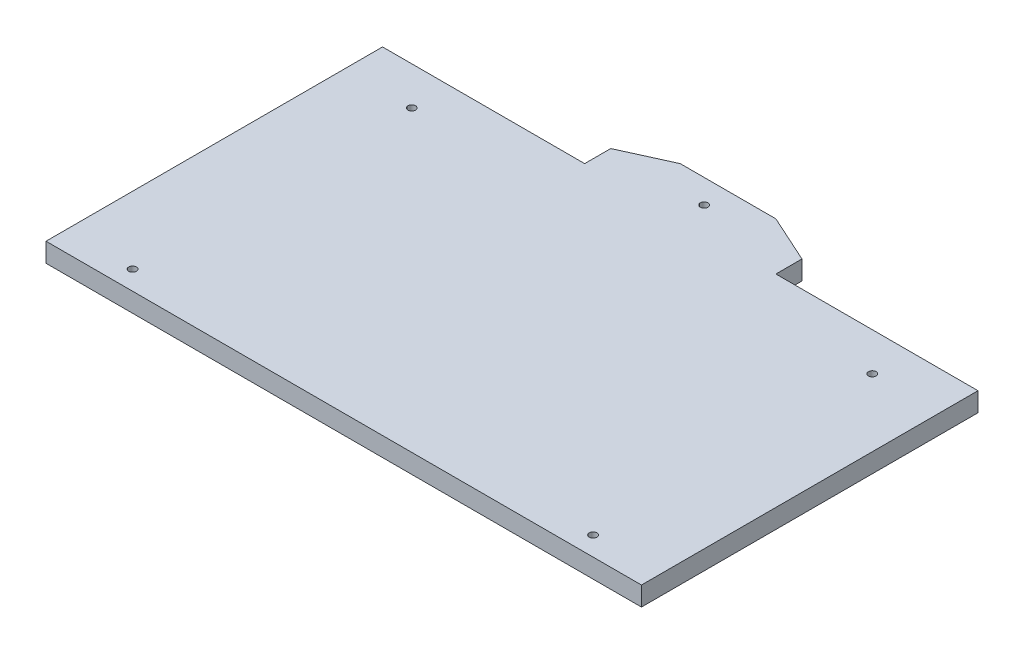
ISO-10303-21;
HEADER;
FILE_DESCRIPTION(('STEP AP214'),'2;1');
FILE_NAME('part.step','',(''),(''),'','','');
FILE_SCHEMA(('AUTOMOTIVE_DESIGN { 1 0 10303 214 1 1 1 1 }'));
ENDSEC;
DATA;
#1=APPLICATION_CONTEXT('core data for automotive mechanical design processes');
#2=APPLICATION_PROTOCOL_DEFINITION('international standard','automotive_design',2000,#1);
#3=PRODUCT_CONTEXT('',#1,'mechanical');
#4=PRODUCT('Part','Part','',(#3));
#5=PRODUCT_RELATED_PRODUCT_CATEGORY('part','',(#4));
#6=PRODUCT_DEFINITION_FORMATION('','',#4);
#7=PRODUCT_DEFINITION_CONTEXT('part definition',#1,'design');
#8=PRODUCT_DEFINITION('design','',#6,#7);
#9=PRODUCT_DEFINITION_SHAPE('','',#8);
#10=(LENGTH_UNIT() NAMED_UNIT(*) SI_UNIT(.MILLI.,.METRE.));
#11=(NAMED_UNIT(*) PLANE_ANGLE_UNIT() SI_UNIT($,.RADIAN.));
#12=(NAMED_UNIT(*) SI_UNIT($,.STERADIAN.) SOLID_ANGLE_UNIT());
#13=UNCERTAINTY_MEASURE_WITH_UNIT(LENGTH_MEASURE(1.E-05),#10,'distance_accuracy_value','');
#14=(GEOMETRIC_REPRESENTATION_CONTEXT(3) GLOBAL_UNCERTAINTY_ASSIGNED_CONTEXT((#13)) GLOBAL_UNIT_ASSIGNED_CONTEXT((#10,
#11,#12)) REPRESENTATION_CONTEXT('',''));
#15=CARTESIAN_POINT('',(0.,0.,0.));
#16=DIRECTION('',(0.,0.,1.));
#17=DIRECTION('',(1.,0.,0.));
#18=AXIS2_PLACEMENT_3D('',#15,#16,#17);
#19=CARTESIAN_POINT('',(0.,5.,-44.));
#20=DIRECTION('',(0.,0.,1.));
#21=DIRECTION('',(1.,0.,0.));
#22=AXIS2_PLACEMENT_3D('',#19,#20,#21);
#23=PLANE('',#22);
#24=DIRECTION('',(0.,1.,0.));
#25=VECTOR('',#24,1.);
#26=CARTESIAN_POINT('',(-23.8283042472908,-51.537589944117,-44.));
#27=LINE('',#26,#25);
#28=CARTESIAN_POINT('',(-23.8283042472908,0.,-44.));
#29=VERTEX_POINT('',#28);
#30=CARTESIAN_POINT('',(-23.8283042472908,5.,-44.));
#31=VERTEX_POINT('',#30);
#32=EDGE_CURVE('E72',#29,#31,#27,.T.);
#33=ORIENTED_EDGE('',*,*,#32,.F.);
#34=DIRECTION('',(-1.,0.,0.));
#35=VECTOR('',#34,1.);
#36=CARTESIAN_POINT('',(0.,0.,-44.));
#37=LINE('',#36,#35);
#38=CARTESIAN_POINT('',(-76.6797078460986,0.,-44.));
#39=VERTEX_POINT('',#38);
#40=EDGE_CURVE('E210',#29,#39,#37,.T.);
#41=ORIENTED_EDGE('',*,*,#40,.T.);
#42=DIRECTION('',(0.,-1.,0.));
#43=VECTOR('',#42,1.);
#44=CARTESIAN_POINT('',(-76.6797078460986,5.,-44.));
#45=LINE('',#44,#43);
#46=CARTESIAN_POINT('',(-76.6797078460986,5.,-44.));
#47=VERTEX_POINT('',#46);
#48=EDGE_CURVE('E57',#47,#39,#45,.T.);
#49=ORIENTED_EDGE('',*,*,#48,.F.);
#50=DIRECTION('',(-1.,0.,0.));
#51=VECTOR('',#50,1.);
#52=CARTESIAN_POINT('',(0.,5.,-44.));
#53=LINE('',#52,#51);
#54=EDGE_CURVE('E196',#31,#47,#53,.T.);
#55=ORIENTED_EDGE('',*,*,#54,.F.);
#56=EDGE_LOOP('',(#33,#41,#49,#55));
#57=FACE_BOUND('',#56,.T.);
#58=ADVANCED_FACE('F48',(#57),#23,.F.);
#59=CARTESIAN_POINT('',(79.023099351517,5.,0.));
#60=DIRECTION('',(1.,0.,0.));
#61=DIRECTION('',(0.,0.,-1.));
#62=AXIS2_PLACEMENT_3D('',#59,#60,#61);
#63=PLANE('',#62);
#64=DIRECTION('',(0.,0.,1.));
#65=VECTOR('',#64,1.);
#66=CARTESIAN_POINT('',(79.023099351517,0.,0.));
#67=LINE('',#66,#65);
#68=CARTESIAN_POINT('',(79.023099351517,0.,-44.));
#69=VERTEX_POINT('',#68);
#70=CARTESIAN_POINT('',(79.023099351517,0.,44.));
#71=VERTEX_POINT('',#70);
#72=EDGE_CURVE('E190',#69,#71,#67,.T.);
#73=ORIENTED_EDGE('',*,*,#72,.F.);
#74=DIRECTION('',(0.,-1.,0.));
#75=VECTOR('',#74,1.);
#76=CARTESIAN_POINT('',(79.023099351517,5.,-44.));
#77=LINE('',#76,#75);
#78=CARTESIAN_POINT('',(79.023099351517,5.,-44.));
#79=VERTEX_POINT('',#78);
#80=EDGE_CURVE('E11',#79,#69,#77,.T.);
#81=ORIENTED_EDGE('',*,*,#80,.F.);
#82=DIRECTION('',(0.,0.,1.));
#83=VECTOR('',#82,1.);
#84=CARTESIAN_POINT('',(79.023099351517,5.,0.));
#85=LINE('',#84,#83);
#86=CARTESIAN_POINT('',(79.023099351517,5.,44.));
#87=VERTEX_POINT('',#86);
#88=EDGE_CURVE('E192',#79,#87,#85,.T.);
#89=ORIENTED_EDGE('',*,*,#88,.T.);
#90=DIRECTION('',(0.,-1.,0.));
#91=VECTOR('',#90,1.);
#92=CARTESIAN_POINT('',(79.023099351517,5.,44.));
#93=LINE('',#92,#91);
#94=EDGE_CURVE('E206',#87,#71,#93,.T.);
#95=ORIENTED_EDGE('',*,*,#94,.T.);
#96=EDGE_LOOP('',(#73,#81,#89,#95));
#97=FACE_BOUND('',#96,.T.);
#98=ADVANCED_FACE('F50',(#97),#63,.T.);
#99=CARTESIAN_POINT('',(26.1716957527092,0.,-44.));
#100=VERTEX_POINT('',#99);
#101=EDGE_CURVE('E211',#69,#100,#37,.T.);
#102=ORIENTED_EDGE('',*,*,#101,.T.);
#103=DIRECTION('',(0.,1.,0.));
#104=VECTOR('',#103,1.);
#105=CARTESIAN_POINT('',(26.1716957527092,-51.537589944117,-44.));
#106=LINE('',#105,#104);
#107=CARTESIAN_POINT('',(26.1716957527092,5.,-44.));
#108=VERTEX_POINT('',#107);
#109=EDGE_CURVE('E64',#100,#108,#106,.T.);
#110=ORIENTED_EDGE('',*,*,#109,.T.);
#111=EDGE_CURVE('E153',#79,#108,#53,.T.);
#112=ORIENTED_EDGE('',*,*,#111,.F.);
#113=ORIENTED_EDGE('',*,*,#80,.T.);
#114=EDGE_LOOP('',(#102,#110,#112,#113));
#115=FACE_BOUND('',#114,.T.);
#116=ADVANCED_FACE('F330',(#115),#23,.F.);
#117=CARTESIAN_POINT('',(-76.6797078460986,5.,0.));
#118=DIRECTION('',(1.,0.,0.));
#119=DIRECTION('',(0.,0.,-1.));
#120=AXIS2_PLACEMENT_3D('',#117,#118,#119);
#121=PLANE('',#120);
#122=DIRECTION('',(0.,0.,1.));
#123=VECTOR('',#122,1.);
#124=CARTESIAN_POINT('',(-76.6797078460986,0.,0.));
#125=LINE('',#124,#123);
#126=CARTESIAN_POINT('',(-76.6797078460986,0.,44.));
#127=VERTEX_POINT('',#126);
#128=EDGE_CURVE('E214',#39,#127,#125,.T.);
#129=ORIENTED_EDGE('',*,*,#128,.T.);
#130=DIRECTION('',(0.,-1.,0.));
#131=VECTOR('',#130,1.);
#132=CARTESIAN_POINT('',(-76.6797078460986,5.,44.));
#133=LINE('',#132,#131);
#134=CARTESIAN_POINT('',(-76.6797078460986,5.,44.));
#135=VERTEX_POINT('',#134);
#136=EDGE_CURVE('E222',#135,#127,#133,.T.);
#137=ORIENTED_EDGE('',*,*,#136,.F.);
#138=DIRECTION('',(0.,0.,1.));
#139=VECTOR('',#138,1.);
#140=CARTESIAN_POINT('',(-76.6797078460986,5.,0.));
#141=LINE('',#140,#139);
#142=EDGE_CURVE('E200',#47,#135,#141,.T.);
#143=ORIENTED_EDGE('',*,*,#142,.F.);
#144=ORIENTED_EDGE('',*,*,#48,.T.);
#145=EDGE_LOOP('',(#129,#137,#143,#144));
#146=FACE_BOUND('',#145,.T.);
#147=ADVANCED_FACE('F232',(#146),#121,.F.);
#148=CARTESIAN_POINT('',(0.,5.,44.));
#149=DIRECTION('',(0.,0.,-1.));
#150=DIRECTION('',(-1.,0.,0.));
#151=AXIS2_PLACEMENT_3D('',#148,#149,#150);
#152=PLANE('',#151);
#153=DIRECTION('',(1.,0.,0.));
#154=VECTOR('',#153,1.);
#155=CARTESIAN_POINT('',(0.,0.,44.));
#156=LINE('',#155,#154);
#157=EDGE_CURVE('E197',#127,#71,#156,.T.);
#158=ORIENTED_EDGE('',*,*,#157,.T.);
#159=ORIENTED_EDGE('',*,*,#94,.F.);
#160=DIRECTION('',(1.,0.,0.));
#161=VECTOR('',#160,1.);
#162=CARTESIAN_POINT('',(0.,5.,44.));
#163=LINE('',#162,#161);
#164=EDGE_CURVE('E203',#135,#87,#163,.T.);
#165=ORIENTED_EDGE('',*,*,#164,.F.);
#166=ORIENTED_EDGE('',*,*,#136,.T.);
#167=EDGE_LOOP('',(#158,#159,#165,#166));
#168=FACE_BOUND('',#167,.T.);
#169=ADVANCED_FACE('F243',(#168),#152,.F.);
#170=CARTESIAN_POINT('',(0.,5.,0.));
#171=DIRECTION('',(0.,1.,0.));
#172=DIRECTION('',(0.,0.,1.));
#173=AXIS2_PLACEMENT_3D('',#170,#171,#172);
#174=PLANE('',#173);
#175=ORIENTED_EDGE('',*,*,#88,.F.);
#176=ORIENTED_EDGE('',*,*,#111,.T.);
#177=DIRECTION('',(0.,0.,-1.));
#178=VECTOR('',#177,1.);
#179=CARTESIAN_POINT('',(26.1716957527092,5.,-44.));
#180=LINE('',#179,#178);
#181=CARTESIAN_POINT('',(26.1716957527092,5.,-50.823606938333));
#182=VERTEX_POINT('',#181);
#183=EDGE_CURVE('E131',#108,#182,#180,.T.);
#184=ORIENTED_EDGE('',*,*,#183,.T.);
#185=DIRECTION('',(-0.910654396943775,0.,-0.413168935578379));
#186=VECTOR('',#185,1.);
#187=CARTESIAN_POINT('',(26.1716957527092,5.,-50.823606938333));
#188=LINE('',#187,#186);
#189=CARTESIAN_POINT('',(13.6716957527092,5.,-56.4949260601234));
#190=VERTEX_POINT('',#189);
#191=EDGE_CURVE('E141',#182,#190,#188,.T.);
#192=ORIENTED_EDGE('',*,*,#191,.T.);
#193=DIRECTION('',(-1.,0.,0.));
#194=VECTOR('',#193,1.);
#195=CARTESIAN_POINT('',(13.6716957527092,5.,-56.4949260601234));
#196=LINE('',#195,#194);
#197=CARTESIAN_POINT('',(-11.3283042472908,5.,-56.4949260601235));
#198=VERTEX_POINT('',#197);
#199=EDGE_CURVE('E148',#190,#198,#196,.T.);
#200=ORIENTED_EDGE('',*,*,#199,.T.);
#201=DIRECTION('',(-0.910654396943774,0.,0.41316893557838));
#202=VECTOR('',#201,1.);
#203=CARTESIAN_POINT('',(-11.3283042472908,5.,-56.4949260601235));
#204=LINE('',#203,#202);
#205=CARTESIAN_POINT('',(-23.8283042472908,5.,-50.823606938333));
#206=VERTEX_POINT('',#205);
#207=EDGE_CURVE('E166',#198,#206,#204,.T.);
#208=ORIENTED_EDGE('',*,*,#207,.T.);
#209=DIRECTION('',(0.,0.,1.));
#210=VECTOR('',#209,1.);
#211=CARTESIAN_POINT('',(-23.8283042472908,5.,-50.823606938333));
#212=LINE('',#211,#210);
#213=EDGE_CURVE('E138',#206,#31,#212,.T.);
#214=ORIENTED_EDGE('',*,*,#213,.T.);
#215=ORIENTED_EDGE('',*,*,#54,.T.);
#216=ORIENTED_EDGE('',*,*,#142,.T.);
#217=ORIENTED_EDGE('',*,*,#164,.T.);
#218=EDGE_LOOP('',(#175,#176,#184,#192,#200,#208,#214,#215,#216,#217));
#219=FACE_BOUND('',#218,.T.);
#220=CARTESIAN_POINT('',(1.17169575270918,5.,-50.2474630300617));
#221=DIRECTION('',(0.,1.,0.));
#222=DIRECTION('',(0.,0.,1.));
#223=AXIS2_PLACEMENT_3D('',#220,#221,#222);
#224=CIRCLE('',#223,1.);
#225=CARTESIAN_POINT('',(1.17169575270918,5.,-49.2474630300617));
#226=VERTEX_POINT('',#225);
#227=EDGE_CURVE('E155',#226,#226,#224,.T.);
#228=ORIENTED_EDGE('',*,*,#227,.F.);
#229=EDGE_LOOP('',(#228));
#230=FACE_BOUND('',#229,.T.);
#231=CARTESIAN_POINT('',(61.3854570382798,5.,-34.));
#232=DIRECTION('',(0.,1.,0.));
#233=DIRECTION('',(0.,0.,1.));
#234=AXIS2_PLACEMENT_3D('',#231,#232,#233);
#235=CIRCLE('',#234,1.);
#236=CARTESIAN_POINT('',(61.3854570382798,5.,-33.));
#237=VERTEX_POINT('',#236);
#238=EDGE_CURVE('E288',#237,#237,#235,.T.);
#239=ORIENTED_EDGE('',*,*,#238,.F.);
#240=EDGE_LOOP('',(#239));
#241=FACE_BOUND('',#240,.T.);
#242=CARTESIAN_POINT('',(61.3854570382798,5.,39.));
#243=DIRECTION('',(0.,1.,0.));
#244=DIRECTION('',(0.,0.,1.));
#245=AXIS2_PLACEMENT_3D('',#242,#243,#244);
#246=CIRCLE('',#245,1.);
#247=CARTESIAN_POINT('',(61.3854570382798,5.,40.));
#248=VERTEX_POINT('',#247);
#249=EDGE_CURVE('E296',#248,#248,#246,.T.);
#250=ORIENTED_EDGE('',*,*,#249,.F.);
#251=EDGE_LOOP('',(#250));
#252=FACE_BOUND('',#251,.T.);
#253=CARTESIAN_POINT('',(-59.0420655328614,5.,39.));
#254=DIRECTION('',(0.,1.,0.));
#255=DIRECTION('',(0.,0.,1.));
#256=AXIS2_PLACEMENT_3D('',#253,#254,#255);
#257=CIRCLE('',#256,0.999999999999994);
#258=CARTESIAN_POINT('',(-59.0420655328614,5.,40.));
#259=VERTEX_POINT('',#258);
#260=EDGE_CURVE('E304',#259,#259,#257,.T.);
#261=ORIENTED_EDGE('',*,*,#260,.F.);
#262=EDGE_LOOP('',(#261));
#263=FACE_BOUND('',#262,.T.);
#264=CARTESIAN_POINT('',(-59.0420655328614,5.,-34.));
#265=DIRECTION('',(0.,1.,0.));
#266=DIRECTION('',(0.,0.,1.));
#267=AXIS2_PLACEMENT_3D('',#264,#265,#266);
#268=CIRCLE('',#267,0.999999999999994);
#269=CARTESIAN_POINT('',(-59.0420655328614,5.,-33.));
#270=VERTEX_POINT('',#269);
#271=EDGE_CURVE('E312',#270,#270,#268,.T.);
#272=ORIENTED_EDGE('',*,*,#271,.F.);
#273=EDGE_LOOP('',(#272));
#274=FACE_BOUND('',#273,.T.);
#275=ADVANCED_FACE('F151',(#219,#230,#241,#252,#263,#274),#174,.T.);
#276=CARTESIAN_POINT('',(0.,0.,0.));
#277=DIRECTION('',(0.,1.,0.));
#278=DIRECTION('',(0.,0.,1.));
#279=AXIS2_PLACEMENT_3D('',#276,#277,#278);
#280=PLANE('',#279);
#281=ORIENTED_EDGE('',*,*,#72,.T.);
#282=ORIENTED_EDGE('',*,*,#157,.F.);
#283=ORIENTED_EDGE('',*,*,#128,.F.);
#284=ORIENTED_EDGE('',*,*,#40,.F.);
#285=DIRECTION('',(0.,0.,-1.));
#286=VECTOR('',#285,1.);
#287=CARTESIAN_POINT('',(-23.8283042472908,0.,-50.823606938333));
#288=LINE('',#287,#286);
#289=CARTESIAN_POINT('',(-23.8283042472908,0.,-50.823606938333));
#290=VERTEX_POINT('',#289);
#291=EDGE_CURVE('E263',#29,#290,#288,.T.);
#292=ORIENTED_EDGE('',*,*,#291,.T.);
#293=DIRECTION('',(0.910654396943774,0.,-0.41316893557838));
#294=VECTOR('',#293,1.);
#295=CARTESIAN_POINT('',(-11.3283042472908,0.,-56.4949260601235));
#296=LINE('',#295,#294);
#297=CARTESIAN_POINT('',(-11.3283042472908,0.,-56.4949260601235));
#298=VERTEX_POINT('',#297);
#299=EDGE_CURVE('E266',#290,#298,#296,.T.);
#300=ORIENTED_EDGE('',*,*,#299,.T.);
#301=DIRECTION('',(1.,0.,0.));
#302=VECTOR('',#301,1.);
#303=CARTESIAN_POINT('',(13.6716957527092,0.,-56.4949260601234));
#304=LINE('',#303,#302);
#305=CARTESIAN_POINT('',(13.6716957527092,0.,-56.4949260601234));
#306=VERTEX_POINT('',#305);
#307=EDGE_CURVE('E175',#298,#306,#304,.T.);
#308=ORIENTED_EDGE('',*,*,#307,.T.);
#309=DIRECTION('',(0.910654396943775,0.,0.413168935578379));
#310=VECTOR('',#309,1.);
#311=CARTESIAN_POINT('',(26.1716957527092,0.,-50.823606938333));
#312=LINE('',#311,#310);
#313=CARTESIAN_POINT('',(26.1716957527092,0.,-50.823606938333));
#314=VERTEX_POINT('',#313);
#315=EDGE_CURVE('E191',#306,#314,#312,.T.);
#316=ORIENTED_EDGE('',*,*,#315,.T.);
#317=DIRECTION('',(0.,0.,1.));
#318=VECTOR('',#317,1.);
#319=CARTESIAN_POINT('',(26.1716957527092,0.,-44.));
#320=LINE('',#319,#318);
#321=EDGE_CURVE('E133',#314,#100,#320,.T.);
#322=ORIENTED_EDGE('',*,*,#321,.T.);
#323=ORIENTED_EDGE('',*,*,#101,.F.);
#324=EDGE_LOOP('',(#281,#282,#283,#284,#292,#300,#308,#316,#322,#323));
#325=FACE_BOUND('',#324,.T.);
#326=CARTESIAN_POINT('',(1.17169575270918,0.,-50.2474630300617));
#327=DIRECTION('',(0.,1.,0.));
#328=DIRECTION('',(0.,0.,1.));
#329=AXIS2_PLACEMENT_3D('',#326,#327,#328);
#330=CIRCLE('',#329,1.);
#331=CARTESIAN_POINT('',(1.17169575270918,0.,-49.2474630300617));
#332=VERTEX_POINT('',#331);
#333=EDGE_CURVE('E186',#332,#332,#330,.F.);
#334=ORIENTED_EDGE('',*,*,#333,.F.);
#335=EDGE_LOOP('',(#334));
#336=FACE_BOUND('',#335,.T.);
#337=CARTESIAN_POINT('',(61.3854570382798,0.,-34.));
#338=DIRECTION('',(0.,1.,0.));
#339=DIRECTION('',(0.,0.,1.));
#340=AXIS2_PLACEMENT_3D('',#337,#338,#339);
#341=CIRCLE('',#340,1.);
#342=CARTESIAN_POINT('',(61.3854570382798,0.,-33.));
#343=VERTEX_POINT('',#342);
#344=EDGE_CURVE('E160',#343,#343,#341,.F.);
#345=ORIENTED_EDGE('',*,*,#344,.F.);
#346=EDGE_LOOP('',(#345));
#347=FACE_BOUND('',#346,.T.);
#348=CARTESIAN_POINT('',(61.3854570382798,0.,39.));
#349=DIRECTION('',(0.,1.,0.));
#350=DIRECTION('',(0.,0.,1.));
#351=AXIS2_PLACEMENT_3D('',#348,#349,#350);
#352=CIRCLE('',#351,1.);
#353=CARTESIAN_POINT('',(61.3854570382798,0.,40.));
#354=VERTEX_POINT('',#353);
#355=EDGE_CURVE('E292',#354,#354,#352,.F.);
#356=ORIENTED_EDGE('',*,*,#355,.F.);
#357=EDGE_LOOP('',(#356));
#358=FACE_BOUND('',#357,.T.);
#359=CARTESIAN_POINT('',(-59.0420655328614,0.,39.));
#360=DIRECTION('',(0.,1.,0.));
#361=DIRECTION('',(0.,0.,1.));
#362=AXIS2_PLACEMENT_3D('',#359,#360,#361);
#363=CIRCLE('',#362,0.999999999999994);
#364=CARTESIAN_POINT('',(-59.0420655328614,0.,40.));
#365=VERTEX_POINT('',#364);
#366=EDGE_CURVE('E300',#365,#365,#363,.F.);
#367=ORIENTED_EDGE('',*,*,#366,.F.);
#368=EDGE_LOOP('',(#367));
#369=FACE_BOUND('',#368,.T.);
#370=CARTESIAN_POINT('',(-59.0420655328614,0.,-34.));
#371=DIRECTION('',(0.,1.,0.));
#372=DIRECTION('',(0.,0.,1.));
#373=AXIS2_PLACEMENT_3D('',#370,#371,#372);
#374=CIRCLE('',#373,0.999999999999994);
#375=CARTESIAN_POINT('',(-59.0420655328614,0.,-33.));
#376=VERTEX_POINT('',#375);
#377=EDGE_CURVE('E308',#376,#376,#374,.F.);
#378=ORIENTED_EDGE('',*,*,#377,.F.);
#379=EDGE_LOOP('',(#378));
#380=FACE_BOUND('',#379,.T.);
#381=ADVANCED_FACE('F236',(#325,#336,#347,#358,#369,#380),#280,.F.);
#382=CARTESIAN_POINT('',(26.1716957527092,-51.537589944117,-50.823606938333));
#383=DIRECTION('',(0.413168935578379,0.,-0.910654396943774));
#384=DIRECTION('',(-0.910654396943775,0.,-0.413168935578379));
#385=AXIS2_PLACEMENT_3D('',#382,#383,#384);
#386=PLANE('',#385);
#387=ORIENTED_EDGE('',*,*,#315,.F.);
#388=DIRECTION('',(0.,1.,0.));
#389=VECTOR('',#388,1.);
#390=CARTESIAN_POINT('',(13.6716957527092,-51.537589944117,-56.4949260601234));
#391=LINE('',#390,#389);
#392=EDGE_CURVE('E137',#306,#190,#391,.T.);
#393=ORIENTED_EDGE('',*,*,#392,.T.);
#394=ORIENTED_EDGE('',*,*,#191,.F.);
#395=DIRECTION('',(0.,1.,0.));
#396=VECTOR('',#395,1.);
#397=CARTESIAN_POINT('',(26.1716957527092,-51.537589944117,-50.823606938333));
#398=LINE('',#397,#396);
#399=EDGE_CURVE('E127',#314,#182,#398,.T.);
#400=ORIENTED_EDGE('',*,*,#399,.F.);
#401=EDGE_LOOP('',(#387,#393,#394,#400));
#402=FACE_BOUND('',#401,.T.);
#403=ADVANCED_FACE('F142',(#402),#386,.T.);
#404=CARTESIAN_POINT('',(13.6716957527092,-51.537589944117,-56.4949260601234));
#405=DIRECTION('',(0.,0.,-1.));
#406=DIRECTION('',(-1.,0.,0.));
#407=AXIS2_PLACEMENT_3D('',#404,#405,#406);
#408=PLANE('',#407);
#409=ORIENTED_EDGE('',*,*,#307,.F.);
#410=DIRECTION('',(0.,1.,0.));
#411=VECTOR('',#410,1.);
#412=CARTESIAN_POINT('',(-11.3283042472908,-51.537589944117,-56.4949260601235));
#413=LINE('',#412,#411);
#414=EDGE_CURVE('E181',#298,#198,#413,.T.);
#415=ORIENTED_EDGE('',*,*,#414,.T.);
#416=ORIENTED_EDGE('',*,*,#199,.F.);
#417=ORIENTED_EDGE('',*,*,#392,.F.);
#418=EDGE_LOOP('',(#409,#415,#416,#417));
#419=FACE_BOUND('',#418,.T.);
#420=ADVANCED_FACE('F365',(#419),#408,.T.);
#421=CARTESIAN_POINT('',(-11.3283042472908,-51.537589944117,-56.4949260601235));
#422=DIRECTION('',(-0.41316893557838,0.,-0.910654396943774));
#423=DIRECTION('',(-0.910654396943774,0.,0.41316893557838));
#424=AXIS2_PLACEMENT_3D('',#421,#422,#423);
#425=PLANE('',#424);
#426=ORIENTED_EDGE('',*,*,#299,.F.);
#427=DIRECTION('',(0.,1.,0.));
#428=VECTOR('',#427,1.);
#429=CARTESIAN_POINT('',(-23.8283042472908,-51.537589944117,-50.823606938333));
#430=LINE('',#429,#428);
#431=EDGE_CURVE('E178',#290,#206,#430,.T.);
#432=ORIENTED_EDGE('',*,*,#431,.T.);
#433=ORIENTED_EDGE('',*,*,#207,.F.);
#434=ORIENTED_EDGE('',*,*,#414,.F.);
#435=EDGE_LOOP('',(#426,#432,#433,#434));
#436=FACE_BOUND('',#435,.T.);
#437=ADVANCED_FACE('F374',(#436),#425,.T.);
#438=CARTESIAN_POINT('',(-23.8283042472908,-51.537589944117,-50.823606938333));
#439=DIRECTION('',(-1.,0.,0.));
#440=DIRECTION('',(0.,0.,1.));
#441=AXIS2_PLACEMENT_3D('',#438,#439,#440);
#442=PLANE('',#441);
#443=ORIENTED_EDGE('',*,*,#291,.F.);
#444=ORIENTED_EDGE('',*,*,#32,.T.);
#445=ORIENTED_EDGE('',*,*,#213,.F.);
#446=ORIENTED_EDGE('',*,*,#431,.F.);
#447=EDGE_LOOP('',(#443,#444,#445,#446));
#448=FACE_BOUND('',#447,.T.);
#449=ADVANCED_FACE('F384',(#448),#442,.T.);
#450=CARTESIAN_POINT('',(26.1716957527092,-51.537589944117,-44.));
#451=DIRECTION('',(1.,0.,0.));
#452=DIRECTION('',(0.,0.,-1.));
#453=AXIS2_PLACEMENT_3D('',#450,#451,#452);
#454=PLANE('',#453);
#455=ORIENTED_EDGE('',*,*,#321,.F.);
#456=ORIENTED_EDGE('',*,*,#399,.T.);
#457=ORIENTED_EDGE('',*,*,#183,.F.);
#458=ORIENTED_EDGE('',*,*,#109,.F.);
#459=EDGE_LOOP('',(#455,#456,#457,#458));
#460=FACE_BOUND('',#459,.T.);
#461=ADVANCED_FACE('F129',(#460),#454,.T.);
#462=CARTESIAN_POINT('',(1.17169575270918,-51.537589944117,-50.2474630300617));
#463=DIRECTION('',(0.,1.,0.));
#464=DIRECTION('',(0.,0.,1.));
#465=AXIS2_PLACEMENT_3D('',#462,#463,#464);
#466=CYLINDRICAL_SURFACE('',#465,1.);
#467=ORIENTED_EDGE('',*,*,#333,.T.);
#468=EDGE_LOOP('',(#467));
#469=FACE_BOUND('',#468,.T.);
#470=ORIENTED_EDGE('',*,*,#227,.T.);
#471=EDGE_LOOP('',(#470));
#472=FACE_BOUND('',#471,.T.);
#473=ADVANCED_FACE('F403',(#469,#472),#466,.F.);
#474=CARTESIAN_POINT('',(61.3854570382798,-4.24264068711927,-34.));
#475=DIRECTION('',(0.,1.,0.));
#476=DIRECTION('',(0.,0.,1.));
#477=AXIS2_PLACEMENT_3D('',#474,#475,#476);
#478=CYLINDRICAL_SURFACE('',#477,1.);
#479=ORIENTED_EDGE('',*,*,#344,.T.);
#480=EDGE_LOOP('',(#479));
#481=FACE_BOUND('',#480,.T.);
#482=ORIENTED_EDGE('',*,*,#238,.T.);
#483=EDGE_LOOP('',(#482));
#484=FACE_BOUND('',#483,.T.);
#485=ADVANCED_FACE('F411',(#481,#484),#478,.F.);
#486=CARTESIAN_POINT('',(61.3854570382798,-4.24264068711927,39.));
#487=DIRECTION('',(0.,1.,0.));
#488=DIRECTION('',(0.,0.,1.));
#489=AXIS2_PLACEMENT_3D('',#486,#487,#488);
#490=CYLINDRICAL_SURFACE('',#489,1.);
#491=ORIENTED_EDGE('',*,*,#355,.T.);
#492=EDGE_LOOP('',(#491));
#493=FACE_BOUND('',#492,.T.);
#494=ORIENTED_EDGE('',*,*,#249,.T.);
#495=EDGE_LOOP('',(#494));
#496=FACE_BOUND('',#495,.T.);
#497=ADVANCED_FACE('F421',(#493,#496),#490,.F.);
#498=CARTESIAN_POINT('',(-59.0420655328614,-4.24264068711927,39.));
#499=DIRECTION('',(0.,1.,0.));
#500=DIRECTION('',(0.,0.,1.));
#501=AXIS2_PLACEMENT_3D('',#498,#499,#500);
#502=CYLINDRICAL_SURFACE('',#501,0.999999999999994);
#503=ORIENTED_EDGE('',*,*,#366,.T.);
#504=EDGE_LOOP('',(#503));
#505=FACE_BOUND('',#504,.T.);
#506=ORIENTED_EDGE('',*,*,#260,.T.);
#507=EDGE_LOOP('',(#506));
#508=FACE_BOUND('',#507,.T.);
#509=ADVANCED_FACE('F431',(#505,#508),#502,.F.);
#510=CARTESIAN_POINT('',(-59.0420655328614,-4.24264068711927,-34.));
#511=DIRECTION('',(0.,1.,0.));
#512=DIRECTION('',(0.,0.,1.));
#513=AXIS2_PLACEMENT_3D('',#510,#511,#512);
#514=CYLINDRICAL_SURFACE('',#513,0.999999999999994);
#515=ORIENTED_EDGE('',*,*,#377,.T.);
#516=EDGE_LOOP('',(#515));
#517=FACE_BOUND('',#516,.T.);
#518=ORIENTED_EDGE('',*,*,#271,.T.);
#519=EDGE_LOOP('',(#518));
#520=FACE_BOUND('',#519,.T.);
#521=ADVANCED_FACE('F318',(#517,#520),#514,.F.);
#522=CLOSED_SHELL('',(#58,#98,#116,#147,#169,#275,#381,#403,#420,#437,#449,#461,#473,#485,#497,
#509,#521));
#523=MANIFOLD_SOLID_BREP('B2',#522);
#524=ADVANCED_BREP_SHAPE_REPRESENTATION('',(#18,#523),#14);
#525=SHAPE_DEFINITION_REPRESENTATION(#9,#524);
ENDSEC;
END-ISO-10303-21;
